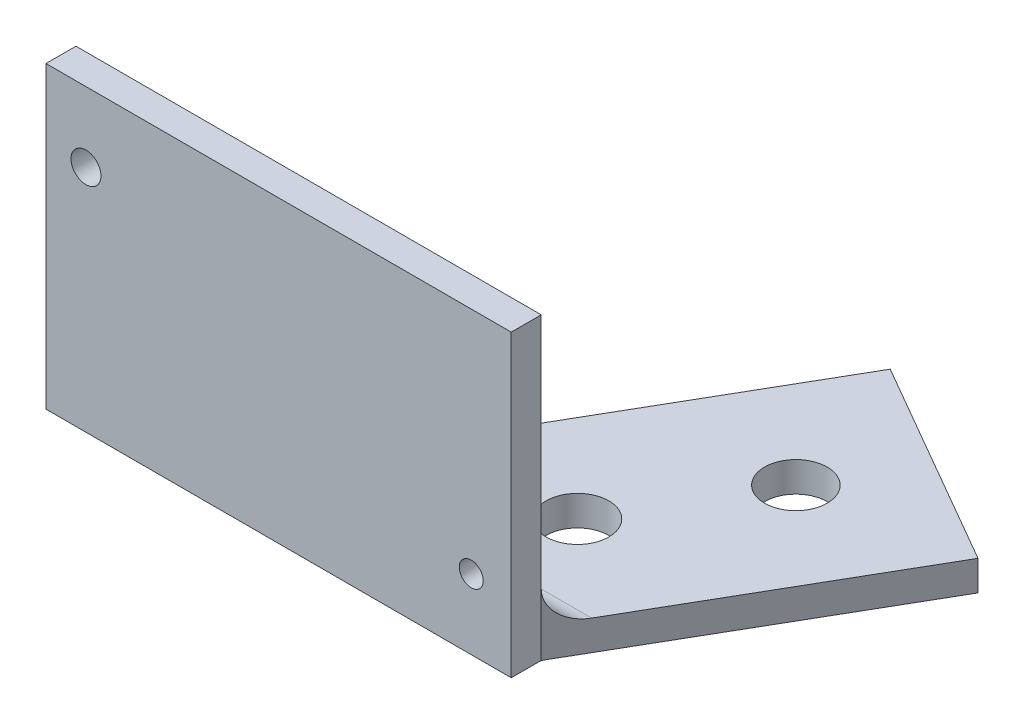
ISO-10303-21;
HEADER;
FILE_DESCRIPTION(('STEP AP214'),'2;1');
FILE_NAME('part.step','',(''),(''),'','','');
FILE_SCHEMA(('AUTOMOTIVE_DESIGN { 1 0 10303 214 1 1 1 1 }'));
ENDSEC;
DATA;
#1=APPLICATION_CONTEXT('core data for automotive mechanical design processes');
#2=APPLICATION_PROTOCOL_DEFINITION('international standard','automotive_design',2000,#1);
#3=PRODUCT_CONTEXT('',#1,'mechanical');
#4=PRODUCT('Part','Part','',(#3));
#5=PRODUCT_RELATED_PRODUCT_CATEGORY('part','',(#4));
#6=PRODUCT_DEFINITION_FORMATION('','',#4);
#7=PRODUCT_DEFINITION_CONTEXT('part definition',#1,'design');
#8=PRODUCT_DEFINITION('design','',#6,#7);
#9=PRODUCT_DEFINITION_SHAPE('','',#8);
#10=(LENGTH_UNIT() NAMED_UNIT(*) SI_UNIT(.MILLI.,.METRE.));
#11=(NAMED_UNIT(*) PLANE_ANGLE_UNIT() SI_UNIT($,.RADIAN.));
#12=(NAMED_UNIT(*) SI_UNIT($,.STERADIAN.) SOLID_ANGLE_UNIT());
#13=UNCERTAINTY_MEASURE_WITH_UNIT(LENGTH_MEASURE(1.E-05),#10,'distance_accuracy_value','');
#14=(GEOMETRIC_REPRESENTATION_CONTEXT(3) GLOBAL_UNCERTAINTY_ASSIGNED_CONTEXT((#13)) GLOBAL_UNIT_ASSIGNED_CONTEXT((#10,
#11,#12)) REPRESENTATION_CONTEXT('',''));
#15=CARTESIAN_POINT('',(0.,0.,0.));
#16=DIRECTION('',(0.,0.,1.));
#17=DIRECTION('',(1.,0.,0.));
#18=AXIS2_PLACEMENT_3D('',#15,#16,#17);
#19=CARTESIAN_POINT('',(0.,0.,2.38125));
#20=DIRECTION('',(0.,0.,-1.));
#21=DIRECTION('',(-1.,0.,0.));
#22=AXIS2_PLACEMENT_3D('',#19,#20,#21);
#23=PLANE('',#22);
#24=DIRECTION('',(0.,-1.,0.));
#25=VECTOR('',#24,1.);
#26=CARTESIAN_POINT('',(-1.5875,-1.5875,2.38125));
#27=LINE('',#26,#25);
#28=CARTESIAN_POINT('',(-1.5875,19.812,2.38125));
#29=VERTEX_POINT('',#28);
#30=CARTESIAN_POINT('',(-1.5875,-3.96875,2.38125));
#31=VERTEX_POINT('',#30);
#32=EDGE_CURVE('E216',#29,#31,#27,.T.);
#33=ORIENTED_EDGE('',*,*,#32,.T.);
#34=DIRECTION('',(-1.,0.,0.));
#35=VECTOR('',#34,1.);
#36=CARTESIAN_POINT('',(-1.5875,-3.96875,2.38125));
#37=LINE('',#36,#35);
#38=CARTESIAN_POINT('',(35.3695,-3.96875,2.38125));
#39=VERTEX_POINT('',#38);
#40=EDGE_CURVE('E156',#39,#31,#37,.T.);
#41=ORIENTED_EDGE('',*,*,#40,.F.);
#42=DIRECTION('',(0.,1.,0.));
#43=VECTOR('',#42,1.);
#44=CARTESIAN_POINT('',(35.3695,-1.5875,2.38125));
#45=LINE('',#44,#43);
#46=CARTESIAN_POINT('',(35.3695,19.812,2.38125));
#47=VERTEX_POINT('',#46);
#48=EDGE_CURVE('E219',#39,#47,#45,.T.);
#49=ORIENTED_EDGE('',*,*,#48,.T.);
#50=DIRECTION('',(-1.,0.,0.));
#51=VECTOR('',#50,1.);
#52=CARTESIAN_POINT('',(-1.5875,19.812,2.38125));
#53=LINE('',#52,#51);
#54=EDGE_CURVE('E223',#47,#29,#53,.T.);
#55=ORIENTED_EDGE('',*,*,#54,.T.);
#56=EDGE_LOOP('',(#33,#41,#49,#55));
#57=FACE_BOUND('',#56,.T.);
#58=CARTESIAN_POINT('',(1.5875,14.25575,2.38125));
#59=DIRECTION('',(0.,0.,1.));
#60=DIRECTION('',(1.,0.,0.));
#61=AXIS2_PLACEMENT_3D('',#58,#59,#60);
#62=CIRCLE('',#61,1.190625);
#63=CARTESIAN_POINT('',(2.778125,14.25575,2.38125));
#64=VERTEX_POINT('',#63);
#65=EDGE_CURVE('E144',#64,#64,#62,.T.);
#66=ORIENTED_EDGE('',*,*,#65,.F.);
#67=EDGE_LOOP('',(#66));
#68=FACE_BOUND('',#67,.T.);
#69=CARTESIAN_POINT('',(32.1945,1.5875,2.38125));
#70=DIRECTION('',(0.,0.,1.));
#71=DIRECTION('',(1.,0.,0.));
#72=AXIS2_PLACEMENT_3D('',#69,#70,#71);
#73=CIRCLE('',#72,0.952500000000004);
#74=CARTESIAN_POINT('',(33.147,1.5875,2.38125));
#75=VERTEX_POINT('',#74);
#76=EDGE_CURVE('E202',#75,#75,#73,.T.);
#77=ORIENTED_EDGE('',*,*,#76,.F.);
#78=EDGE_LOOP('',(#77));
#79=FACE_BOUND('',#78,.T.);
#80=ADVANCED_FACE('F43',(#57,#68,#79),#23,.F.);
#81=CARTESIAN_POINT('',(0.,0.,0.));
#82=DIRECTION('',(0.,0.,-1.));
#83=DIRECTION('',(-1.,0.,0.));
#84=AXIS2_PLACEMENT_3D('',#81,#82,#83);
#85=PLANE('',#84);
#86=CARTESIAN_POINT('',(1.5875,14.25575,0.));
#87=DIRECTION('',(0.,0.,1.));
#88=DIRECTION('',(1.,0.,0.));
#89=AXIS2_PLACEMENT_3D('',#86,#87,#88);
#90=CIRCLE('',#89,1.190625);
#91=CARTESIAN_POINT('',(2.778125,14.25575,0.));
#92=VERTEX_POINT('',#91);
#93=EDGE_CURVE('E206',#92,#92,#90,.T.);
#94=ORIENTED_EDGE('',*,*,#93,.T.);
#95=EDGE_LOOP('',(#94));
#96=FACE_BOUND('',#95,.T.);
#97=DIRECTION('',(0.,1.,0.));
#98=VECTOR('',#97,1.);
#99=CARTESIAN_POINT('',(35.3695,-1.5875,0.));
#100=LINE('',#99,#98);
#101=CARTESIAN_POINT('',(35.3695,0.9525,0.));
#102=VERTEX_POINT('',#101);
#103=CARTESIAN_POINT('',(35.3695,19.812,0.));
#104=VERTEX_POINT('',#103);
#105=EDGE_CURVE('E143',#102,#104,#100,.T.);
#106=ORIENTED_EDGE('',*,*,#105,.F.);
#107=DIRECTION('',(1.,0.,0.));
#108=VECTOR('',#107,1.);
#109=CARTESIAN_POINT('',(13.3724547438752,0.9525,0.));
#110=LINE('',#109,#108);
#111=CARTESIAN_POINT('',(32.9044515828562,0.952499999999999,0.));
#112=VERTEX_POINT('',#111);
#113=EDGE_CURVE('E290',#102,#112,#110,.F.);
#114=ORIENTED_EDGE('',*,*,#113,.T.);
#115=CARTESIAN_POINT('',(32.1945,1.5875,0.));
#116=DIRECTION('',(0.,0.,1.));
#117=DIRECTION('',(1.,0.,0.));
#118=AXIS2_PLACEMENT_3D('',#115,#116,#117);
#119=CIRCLE('',#118,0.952500000000004);
#120=CARTESIAN_POINT('',(31.4845484171438,0.9525,0.));
#121=VERTEX_POINT('',#120);
#122=EDGE_CURVE('E201',#112,#121,#119,.T.);
#123=ORIENTED_EDGE('',*,*,#122,.T.);
#124=DIRECTION('',(1.,0.,0.));
#125=VECTOR('',#124,1.);
#126=CARTESIAN_POINT('',(13.3724547438752,0.9525,0.));
#127=LINE('',#126,#125);
#128=CARTESIAN_POINT('',(13.3724547438752,0.952499999999998,0.));
#129=VERTEX_POINT('',#128);
#130=EDGE_CURVE('E291',#121,#129,#127,.F.);
#131=ORIENTED_EDGE('',*,*,#130,.T.);
#132=DIRECTION('',(0.,1.,0.));
#133=VECTOR('',#132,1.);
#134=CARTESIAN_POINT('',(13.3724547438752,-3.96875,0.));
#135=LINE('',#134,#133);
#136=CARTESIAN_POINT('',(13.3724547438752,-3.96875,0.));
#137=VERTEX_POINT('',#136);
#138=EDGE_CURVE('E72',#137,#129,#135,.T.);
#139=ORIENTED_EDGE('',*,*,#138,.F.);
#140=DIRECTION('',(1.,0.,0.));
#141=VECTOR('',#140,1.);
#142=CARTESIAN_POINT('',(13.3724547438752,-3.96875,0.));
#143=LINE('',#142,#141);
#144=CARTESIAN_POINT('',(-1.5875,-3.96875,0.));
#145=VERTEX_POINT('',#144);
#146=EDGE_CURVE('E146',#145,#137,#143,.T.);
#147=ORIENTED_EDGE('',*,*,#146,.F.);
#148=DIRECTION('',(0.,-1.,0.));
#149=VECTOR('',#148,1.);
#150=CARTESIAN_POINT('',(-1.5875,-1.5875,0.));
#151=LINE('',#150,#149);
#152=CARTESIAN_POINT('',(-1.5875,19.812,0.));
#153=VERTEX_POINT('',#152);
#154=EDGE_CURVE('E132',#153,#145,#151,.T.);
#155=ORIENTED_EDGE('',*,*,#154,.F.);
#156=DIRECTION('',(-1.,0.,0.));
#157=VECTOR('',#156,1.);
#158=CARTESIAN_POINT('',(-1.5875,19.812,0.));
#159=LINE('',#158,#157);
#160=EDGE_CURVE('E220',#104,#153,#159,.T.);
#161=ORIENTED_EDGE('',*,*,#160,.F.);
#162=EDGE_LOOP('',(#106,#114,#123,#131,#139,#147,#155,#161));
#163=FACE_BOUND('',#162,.T.);
#164=ADVANCED_FACE('F147',(#96,#163),#85,.T.);
#165=CARTESIAN_POINT('',(-1.5875,-1.5875,2.38125));
#166=DIRECTION('',(1.,0.,0.));
#167=DIRECTION('',(0.,0.,-1.));
#168=AXIS2_PLACEMENT_3D('',#165,#166,#167);
#169=PLANE('',#168);
#170=ORIENTED_EDGE('',*,*,#154,.T.);
#171=DIRECTION('',(0.,0.,-1.));
#172=VECTOR('',#171,1.);
#173=CARTESIAN_POINT('',(-1.5875,-3.96875,2.38125));
#174=LINE('',#173,#172);
#175=EDGE_CURVE('E137',#31,#145,#174,.T.);
#176=ORIENTED_EDGE('',*,*,#175,.F.);
#177=ORIENTED_EDGE('',*,*,#32,.F.);
#178=DIRECTION('',(0.,0.,-1.));
#179=VECTOR('',#178,1.);
#180=CARTESIAN_POINT('',(-1.5875,19.812,2.38125));
#181=LINE('',#180,#179);
#182=EDGE_CURVE('E139',#29,#153,#181,.T.);
#183=ORIENTED_EDGE('',*,*,#182,.T.);
#184=EDGE_LOOP('',(#170,#176,#177,#183));
#185=FACE_BOUND('',#184,.T.);
#186=ADVANCED_FACE('F134',(#185),#169,.F.);
#187=CARTESIAN_POINT('',(35.3695,-1.5875,2.38125));
#188=DIRECTION('',(-1.,0.,0.));
#189=DIRECTION('',(0.,0.,1.));
#190=AXIS2_PLACEMENT_3D('',#187,#188,#189);
#191=PLANE('',#190);
#192=DIRECTION('',(0.,1.,0.));
#193=VECTOR('',#192,1.);
#194=CARTESIAN_POINT('',(35.3695,-3.96875,0.));
#195=LINE('',#194,#193);
#196=CARTESIAN_POINT('',(35.3695,-3.96875,0.));
#197=VERTEX_POINT('',#196);
#198=EDGE_CURVE('E65',#197,#102,#195,.T.);
#199=ORIENTED_EDGE('',*,*,#198,.T.);
#200=ORIENTED_EDGE('',*,*,#105,.T.);
#201=DIRECTION('',(0.,0.,-1.));
#202=VECTOR('',#201,1.);
#203=CARTESIAN_POINT('',(35.3695,19.812,2.38125));
#204=LINE('',#203,#202);
#205=EDGE_CURVE('E232',#47,#104,#204,.T.);
#206=ORIENTED_EDGE('',*,*,#205,.F.);
#207=ORIENTED_EDGE('',*,*,#48,.F.);
#208=DIRECTION('',(0.,0.,1.));
#209=VECTOR('',#208,1.);
#210=CARTESIAN_POINT('',(35.3695,-3.96875,2.38125));
#211=LINE('',#210,#209);
#212=EDGE_CURVE('E178',#197,#39,#211,.T.);
#213=ORIENTED_EDGE('',*,*,#212,.F.);
#214=EDGE_LOOP('',(#199,#200,#206,#207,#213));
#215=FACE_BOUND('',#214,.T.);
#216=ADVANCED_FACE('F317',(#215),#191,.F.);
#217=CARTESIAN_POINT('',(-1.5875,19.812,2.38125));
#218=DIRECTION('',(0.,-1.,0.));
#219=DIRECTION('',(1.,0.,0.));
#220=AXIS2_PLACEMENT_3D('',#217,#218,#219);
#221=PLANE('',#220);
#222=ORIENTED_EDGE('',*,*,#160,.T.);
#223=ORIENTED_EDGE('',*,*,#182,.F.);
#224=ORIENTED_EDGE('',*,*,#54,.F.);
#225=ORIENTED_EDGE('',*,*,#205,.T.);
#226=EDGE_LOOP('',(#222,#223,#224,#225));
#227=FACE_BOUND('',#226,.T.);
#228=ADVANCED_FACE('F323',(#227),#221,.F.);
#229=CARTESIAN_POINT('',(1.5875,14.25575,2.38125));
#230=DIRECTION('',(0.,0.,-1.));
#231=DIRECTION('',(-1.,0.,0.));
#232=AXIS2_PLACEMENT_3D('',#229,#230,#231);
#233=CYLINDRICAL_SURFACE('',#232,1.190625);
#234=ORIENTED_EDGE('',*,*,#65,.T.);
#235=EDGE_LOOP('',(#234));
#236=FACE_BOUND('',#235,.T.);
#237=ORIENTED_EDGE('',*,*,#93,.F.);
#238=EDGE_LOOP('',(#237));
#239=FACE_BOUND('',#238,.T.);
#240=ADVANCED_FACE('F328',(#236,#239),#233,.F.);
#241=CARTESIAN_POINT('',(32.1945,1.5875,2.38125));
#242=DIRECTION('',(0.,0.,-1.));
#243=DIRECTION('',(-1.,0.,0.));
#244=AXIS2_PLACEMENT_3D('',#241,#242,#243);
#245=CYLINDRICAL_SURFACE('',#244,0.952500000000004);
#246=ORIENTED_EDGE('',*,*,#76,.T.);
#247=EDGE_LOOP('',(#246));
#248=FACE_BOUND('',#247,.T.);
#249=EDGE_CURVE('E207',#121,#112,#119,.T.);
#250=ORIENTED_EDGE('',*,*,#249,.F.);
#251=ORIENTED_EDGE('',*,*,#122,.F.);
#252=EDGE_LOOP('',(#250,#251));
#253=FACE_BOUND('',#252,.T.);
#254=ADVANCED_FACE('F276',(#248,#253),#245,.F.);
#255=CARTESIAN_POINT('',(31.5717160579066,-3.96875,-31.5220452561248));
#256=DIRECTION('',(0.866025403784436,0.,0.500000000000004));
#257=DIRECTION('',(0.500000000000004,0.,-0.866025403784436));
#258=AXIS2_PLACEMENT_3D('',#255,#256,#257);
#259=PLANE('',#258);
#260=ORIENTED_EDGE('',*,*,#138,.T.);
#261=CARTESIAN_POINT('',(14.8389244276169,0.9525,-2.54));
#262=DIRECTION('',(0.866025403784436,0.,0.500000000000004));
#263=DIRECTION('',(-0.500000000000004,0.,0.866025403784436));
#264=AXIS2_PLACEMENT_3D('',#261,#262,#263);
#265=ELLIPSE('',#264,2.93293936748331,2.54);
#266=CARTESIAN_POINT('',(14.8389244276169,-1.5875,-2.54));
#267=VERTEX_POINT('',#266);
#268=EDGE_CURVE('E11',#129,#267,#265,.T.);
#269=ORIENTED_EDGE('',*,*,#268,.T.);
#270=DIRECTION('',(0.500000000000004,0.,-0.866025403784436));
#271=VECTOR('',#270,1.);
#272=CARTESIAN_POINT('',(31.5717160579066,-1.5875,-31.5220452561248));
#273=LINE('',#272,#271);
#274=CARTESIAN_POINT('',(31.5717160579066,-1.5875,-31.5220452561248));
#275=VERTEX_POINT('',#274);
#276=EDGE_CURVE('E183',#267,#275,#273,.T.);
#277=ORIENTED_EDGE('',*,*,#276,.T.);
#278=DIRECTION('',(0.,1.,0.));
#279=VECTOR('',#278,1.);
#280=CARTESIAN_POINT('',(31.5717160579066,-3.96875,-31.5220452561248));
#281=LINE('',#280,#279);
#282=CARTESIAN_POINT('',(31.5717160579066,-3.96875,-31.5220452561248));
#283=VERTEX_POINT('',#282);
#284=EDGE_CURVE('E195',#283,#275,#281,.T.);
#285=ORIENTED_EDGE('',*,*,#284,.F.);
#286=DIRECTION('',(0.500000000000004,0.,-0.866025403784436));
#287=VECTOR('',#286,1.);
#288=CARTESIAN_POINT('',(31.5717160579066,-3.96875,-31.5220452561248));
#289=LINE('',#288,#287);
#290=EDGE_CURVE('E150',#137,#283,#289,.T.);
#291=ORIENTED_EDGE('',*,*,#290,.F.);
#292=EDGE_LOOP('',(#260,#269,#277,#285,#291));
#293=FACE_BOUND('',#292,.T.);
#294=ADVANCED_FACE('F316',(#293),#259,.F.);
#295=CARTESIAN_POINT('',(48.0695000000001,-3.96875,-21.9970452561247));
#296=DIRECTION('',(-0.500000000000005,0.,0.866025403784436));
#297=DIRECTION('',(0.866025403784436,0.,0.500000000000005));
#298=AXIS2_PLACEMENT_3D('',#295,#296,#297);
#299=PLANE('',#298);
#300=DIRECTION('',(0.866025403784436,0.,0.500000000000005));
#301=VECTOR('',#300,1.);
#302=CARTESIAN_POINT('',(48.0695000000001,-1.5875,-21.9970452561247));
#303=LINE('',#302,#301);
#304=CARTESIAN_POINT('',(48.0695000000001,-1.5875,-21.9970452561247));
#305=VERTEX_POINT('',#304);
#306=EDGE_CURVE('E164',#275,#305,#303,.T.);
#307=ORIENTED_EDGE('',*,*,#306,.T.);
#308=DIRECTION('',(0.,1.,0.));
#309=VECTOR('',#308,1.);
#310=CARTESIAN_POINT('',(48.0695000000001,-3.96875,-21.9970452561247));
#311=LINE('',#310,#309);
#312=CARTESIAN_POINT('',(48.0695000000001,-3.96875,-21.9970452561247));
#313=VERTEX_POINT('',#312);
#314=EDGE_CURVE('E191',#313,#305,#311,.T.);
#315=ORIENTED_EDGE('',*,*,#314,.F.);
#316=DIRECTION('',(0.866025403784436,0.,0.500000000000005));
#317=VECTOR('',#316,1.);
#318=CARTESIAN_POINT('',(48.0695000000001,-3.96875,-21.9970452561247));
#319=LINE('',#318,#317);
#320=EDGE_CURVE('E172',#283,#313,#319,.T.);
#321=ORIENTED_EDGE('',*,*,#320,.F.);
#322=ORIENTED_EDGE('',*,*,#284,.T.);
#323=EDGE_LOOP('',(#307,#315,#321,#322));
#324=FACE_BOUND('',#323,.T.);
#325=ADVANCED_FACE('F314',(#324),#299,.F.);
#326=CARTESIAN_POINT('',(48.0695000000001,-3.96875,-21.9970452561247));
#327=DIRECTION('',(-0.866025403784436,0.,-0.500000000000004));
#328=DIRECTION('',(-0.500000000000004,0.,0.866025403784436));
#329=AXIS2_PLACEMENT_3D('',#326,#327,#328);
#330=PLANE('',#329);
#331=DIRECTION('',(-0.500000000000004,0.,0.866025403784436));
#332=VECTOR('',#331,1.);
#333=CARTESIAN_POINT('',(48.0695000000001,-1.5875,-21.9970452561247));
#334=LINE('',#333,#332);
#335=CARTESIAN_POINT('',(36.8359696837417,-1.5875,-2.54));
#336=VERTEX_POINT('',#335);
#337=EDGE_CURVE('E158',#305,#336,#334,.T.);
#338=ORIENTED_EDGE('',*,*,#337,.T.);
#339=CARTESIAN_POINT('',(36.8359696837417,0.9525,-2.54));
#340=DIRECTION('',(-0.866025403784436,0.,-0.500000000000004));
#341=DIRECTION('',(-0.500000000000004,0.,0.866025403784436));
#342=AXIS2_PLACEMENT_3D('',#339,#340,#341);
#343=ELLIPSE('',#342,2.93293936748331,2.54);
#344=EDGE_CURVE('E57',#336,#102,#343,.T.);
#345=ORIENTED_EDGE('',*,*,#344,.T.);
#346=ORIENTED_EDGE('',*,*,#198,.F.);
#347=DIRECTION('',(-0.500000000000004,0.,0.866025403784436));
#348=VECTOR('',#347,1.);
#349=CARTESIAN_POINT('',(48.0695000000001,-3.96875,-21.9970452561247));
#350=LINE('',#349,#348);
#351=EDGE_CURVE('E175',#313,#197,#350,.T.);
#352=ORIENTED_EDGE('',*,*,#351,.F.);
#353=ORIENTED_EDGE('',*,*,#314,.T.);
#354=EDGE_LOOP('',(#338,#345,#346,#352,#353));
#355=FACE_BOUND('',#354,.T.);
#356=ADVANCED_FACE('F260',(#355),#330,.F.);
#357=CARTESIAN_POINT('',(0.,-3.96875,0.));
#358=DIRECTION('',(0.,1.,0.));
#359=DIRECTION('',(0.,0.,1.));
#360=AXIS2_PLACEMENT_3D('',#357,#358,#359);
#361=PLANE('',#360);
#362=CARTESIAN_POINT('',(35.8009773719377,-3.96875,-19.7973407305122));
#363=DIRECTION('',(0.,1.,0.));
#364=DIRECTION('',(0.,0.,1.));
#365=AXIS2_PLACEMENT_3D('',#362,#363,#364);
#366=CIRCLE('',#365,2.48919999999999);
#367=CARTESIAN_POINT('',(35.8009773719377,-3.96875,-17.3081407305122));
#368=VERTEX_POINT('',#367);
#369=EDGE_CURVE('E186',#368,#368,#366,.F.);
#370=ORIENTED_EDGE('',*,*,#369,.F.);
#371=EDGE_LOOP('',(#370));
#372=FACE_BOUND('',#371,.T.);
#373=CARTESIAN_POINT('',(29.4509773719376,-3.96875,-8.79881810244987));
#374=DIRECTION('',(0.,1.,0.));
#375=DIRECTION('',(0.,0.,1.));
#376=AXIS2_PLACEMENT_3D('',#373,#374,#375);
#377=CIRCLE('',#376,2.48919999999999);
#378=CARTESIAN_POINT('',(29.4509773719376,-3.96875,-6.30961810244988));
#379=VERTEX_POINT('',#378);
#380=EDGE_CURVE('E167',#379,#379,#377,.F.);
#381=ORIENTED_EDGE('',*,*,#380,.F.);
#382=EDGE_LOOP('',(#381));
#383=FACE_BOUND('',#382,.T.);
#384=ORIENTED_EDGE('',*,*,#175,.T.);
#385=ORIENTED_EDGE('',*,*,#146,.T.);
#386=ORIENTED_EDGE('',*,*,#290,.T.);
#387=ORIENTED_EDGE('',*,*,#320,.T.);
#388=ORIENTED_EDGE('',*,*,#351,.T.);
#389=ORIENTED_EDGE('',*,*,#212,.T.);
#390=ORIENTED_EDGE('',*,*,#40,.T.);
#391=EDGE_LOOP('',(#384,#385,#386,#387,#388,#389,#390));
#392=FACE_BOUND('',#391,.T.);
#393=ADVANCED_FACE('F153',(#372,#383,#392),#361,.F.);
#394=CARTESIAN_POINT('',(0.,-1.5875,0.));
#395=DIRECTION('',(0.,1.,0.));
#396=DIRECTION('',(0.,0.,1.));
#397=AXIS2_PLACEMENT_3D('',#394,#395,#396);
#398=PLANE('',#397);
#399=CARTESIAN_POINT('',(35.8009773719377,-1.5875,-19.7973407305122));
#400=DIRECTION('',(0.,1.,0.));
#401=DIRECTION('',(0.,0.,1.));
#402=AXIS2_PLACEMENT_3D('',#399,#400,#401);
#403=CIRCLE('',#402,2.48919999999999);
#404=CARTESIAN_POINT('',(35.8009773719377,-1.5875,-17.3081407305122));
#405=VERTEX_POINT('',#404);
#406=EDGE_CURVE('E490',#405,#405,#403,.T.);
#407=ORIENTED_EDGE('',*,*,#406,.F.);
#408=EDGE_LOOP('',(#407));
#409=FACE_BOUND('',#408,.T.);
#410=CARTESIAN_POINT('',(29.4509773719376,-1.5875,-8.79881810244987));
#411=DIRECTION('',(0.,1.,0.));
#412=DIRECTION('',(0.,0.,1.));
#413=AXIS2_PLACEMENT_3D('',#410,#411,#412);
#414=CIRCLE('',#413,2.48919999999999);
#415=CARTESIAN_POINT('',(29.4509773719376,-1.5875,-6.30961810244988));
#416=VERTEX_POINT('',#415);
#417=EDGE_CURVE('E285',#416,#416,#414,.T.);
#418=ORIENTED_EDGE('',*,*,#417,.F.);
#419=EDGE_LOOP('',(#418));
#420=FACE_BOUND('',#419,.T.);
#421=ORIENTED_EDGE('',*,*,#276,.F.);
#422=DIRECTION('',(1.,0.,0.));
#423=VECTOR('',#422,1.);
#424=CARTESIAN_POINT('',(35.3695,-1.5875,-2.54));
#425=LINE('',#424,#423);
#426=CARTESIAN_POINT('',(31.4845484171438,-1.5875,-2.54));
#427=VERTEX_POINT('',#426);
#428=EDGE_CURVE('E246',#267,#427,#425,.T.);
#429=ORIENTED_EDGE('',*,*,#428,.T.);
#430=CARTESIAN_POINT('',(33.0692999017509,1.2106958308397,0.));
#431=CARTESIAN_POINT('',(33.0014712577612,-1.5875,0.277761115839572));
#432=CARTESIAN_POINT('',(33.6687351526644,-1.5875,-2.45471226275083));
#433=CARTESIAN_POINT('',(33.0649493760835,1.20066299174167,0.));
#434=CARTESIAN_POINT('',(33.0048063145353,-1.5875,0.267064646921252));
#435=CARTESIAN_POINT('',(33.6222502111467,-1.5875,-2.4660699515731));
#436=CARTESIAN_POINT('',(33.0601192943247,1.18986337126937,0.));
#437=CARTESIAN_POINT('',(33.0072355004681,-1.5875,0.255271056876502));
#438=CARTESIAN_POINT('',(33.5754734478419,-1.5875,-2.47621055300328));
#439=CARTESIAN_POINT('',(33.0489447606538,1.16635421885707,0.));
#440=CARTESIAN_POINT('',(33.0094209974983,-1.5875,0.229307890928058));
#441=CARTESIAN_POINT('',(33.4814897764869,-1.5875,-2.49413046805221));
#442=CARTESIAN_POINT('',(33.0426009604331,1.15364550969433,0.));
#443=CARTESIAN_POINT('',(33.0091910892721,-1.5875,0.215161557368592));
#444=CARTESIAN_POINT('',(33.4342830619299,-1.5875,-2.50191079455947));
#445=CARTESIAN_POINT('',(33.0279174612061,1.12607751024489,0.));
#446=CARTESIAN_POINT('',(33.0052882623959,-1.5875,0.184479367763835));
#447=CARTESIAN_POINT('',(33.340043851604,-1.5875,-2.5151238278455));
#448=CARTESIAN_POINT('',(33.0195991360774,1.11124188157453,0.));
#449=CARTESIAN_POINT('',(33.001672680499,-1.5875,0.167999062552473));
#450=CARTESIAN_POINT('',(33.2930146234616,-1.5875,-2.52058003682317));
#451=CARTESIAN_POINT('',(33.0000656961369,1.07889406406731,0.));
#452=CARTESIAN_POINT('',(32.9899569107736,-1.5875,0.132427337531588));
#453=CARTESIAN_POINT('',(33.198757152589,-1.5875,-2.52939150029441));
#454=CARTESIAN_POINT('',(32.9888502815108,1.06138159828625,0.));
#455=CARTESIAN_POINT('',(32.9818924006681,-1.5875,0.113371638870963));
#456=CARTESIAN_POINT('',(33.1515288897591,-1.5875,-2.53274653721851));
#457=CARTESIAN_POINT('',(32.9622627883849,1.02328462008303,0.));
#458=CARTESIAN_POINT('',(32.9598687090111,-1.5875,0.0726841033378057));
#459=CARTESIAN_POINT('',(33.0569906293649,-1.5875,-2.5375455619213));
#460=CARTESIAN_POINT('',(32.9468917663299,1.00270088903774,0.));
#461=CARTESIAN_POINT('',(32.9459692352721,-1.5875,0.0510963770627656));
#462=CARTESIAN_POINT('',(33.0096806556065,-1.5875,-2.5389900348573));
#463=CARTESIAN_POINT('',(32.9101539263323,0.958269933551349,0.));
#464=CARTESIAN_POINT('',(32.9104793698422,-1.5875,0.00569031483444232));
#465=CARTESIAN_POINT('',(32.9150468740514,-1.5875,-2.5402506993597));
#466=CARTESIAN_POINT('',(32.888787614152,0.934422984482088,0.));
#467=CARTESIAN_POINT('',(32.8889778413449,-1.5875,-0.0180816429906292));
#468=CARTESIAN_POINT('',(32.8677230677579,-1.5875,-2.54006702823631));
#469=CARTESIAN_POINT('',(32.8374573807926,0.883815850601244,0.));
#470=CARTESIAN_POINT('',(32.8360901972884,-1.5875,-0.0669587187338391));
#471=CARTESIAN_POINT('',(32.7730087935178,-1.5875,-2.53847213285447));
#472=CARTESIAN_POINT('',(32.8074769162276,0.857050122269502,0.));
#473=CARTESIAN_POINT('',(32.804805586983,-1.5875,-0.0920308803853365));
#474=CARTESIAN_POINT('',(32.7256183735943,-1.5875,-2.53705853583964));
#475=CARTESIAN_POINT('',(32.7538150813141,0.816190385787285,0.));
#476=CARTESIAN_POINT('',(32.7488340315505,-1.5875,-0.129120475739469));
#477=CARTESIAN_POINT('',(32.6545482029237,-1.5875,-2.53444014075199));
#478=CARTESIAN_POINT('',(32.7344766692034,0.802450395918323,0.));
#479=CARTESIAN_POINT('',(32.7287622014793,-1.5875,-0.141351801945108));
#480=CARTESIAN_POINT('',(32.6308581121642,-1.5875,-2.5334842096354));
#481=CARTESIAN_POINT('',(32.6925837721007,0.775221985755937,0.));
#482=CARTESIAN_POINT('',(32.6855301882946,-1.5875,-0.165191997363054));
#483=CARTESIAN_POINT('',(32.5834808761158,-1.5875,-2.53149419246097));
#484=CARTESIAN_POINT('',(32.6700292469045,0.761733568609772,0.));
#485=CARTESIAN_POINT('',(32.6623826121017,-1.5875,-0.176805537520036));
#486=CARTESIAN_POINT('',(32.5597937308673,-1.5875,-2.53046010542621));
#487=CARTESIAN_POINT('',(32.6091240212498,0.728972305394364,0.));
#488=CARTESIAN_POINT('',(32.6004487152796,-1.5875,-0.204536963453388));
#489=CARTESIAN_POINT('',(32.5003593262729,-1.5875,-2.52788385953011));
#490=CARTESIAN_POINT('',(32.5685772768692,0.71025062086094,0.));
#491=CARTESIAN_POINT('',(32.5596043958583,-1.5875,-0.220014251293308));
#492=CARTESIAN_POINT('',(32.4646116371859,-1.5875,-2.52635106220542));
#493=CARTESIAN_POINT('',(32.4800063264668,0.677579977266468,0.));
#494=CARTESIAN_POINT('',(32.4716000061884,-1.5875,-0.246520264247603));
#495=CARTESIAN_POINT('',(32.3931022829211,-1.5875,-2.52364939065413));
#496=CARTESIAN_POINT('',(32.4319823030397,0.66363090168523,0.));
#497=CARTESIAN_POINT('',(32.4243998142152,-1.5875,-0.257598098705576));
#498=CARTESIAN_POINT('',(32.3573406181059,-1.5875,-2.52248050754285));
#499=CARTESIAN_POINT('',(32.3308445290396,0.643408039989066,0.));
#500=CARTESIAN_POINT('',(32.325999783557,-1.5875,-0.273493140157611));
#501=CARTESIAN_POINT('',(32.2858188990347,-1.5875,-2.52078453844386));
#502=CARTESIAN_POINT('',(32.2777333727165,0.637130363980252,0.));
#503=CARTESIAN_POINT('',(32.2746830785738,-1.5875,-0.278357235783302));
#504=CARTESIAN_POINT('',(32.2500588531641,-1.5875,-2.52025712718921));
#505=CARTESIAN_POINT('',(32.1706300371423,0.633794798816263,0.));
#506=CARTESIAN_POINT('',(32.1715167833265,-1.5875,-0.280942616267311));
#507=CARTESIAN_POINT('',(32.1785359827611,-1.5875,-2.51997682615275));
#508=CARTESIAN_POINT('',(32.1166378710342,0.636736772245921,0.));
#509=CARTESIAN_POINT('',(32.1195011897372,-1.5875,-0.278672346667566));
#510=CARTESIAN_POINT('',(32.142773158278,-1.5875,-2.52022392482718));
#511=CARTESIAN_POINT('',(32.0124606122548,0.651075858697316,0.));
#512=CARTESIAN_POINT('',(32.0186784462365,-1.5875,-0.267485527491931));
#513=CARTESIAN_POINT('',(32.0713237504813,-1.5875,-2.52142808746478));
#514=CARTESIAN_POINT('',(31.9622689603857,0.66245802071419,0.));
#515=CARTESIAN_POINT('',(31.9697232432501,-1.5875,-0.258547302455054));
#516=CARTESIAN_POINT('',(32.0356371441208,-1.5875,-2.52238389601449));
#517=CARTESIAN_POINT('',(31.8687066383386,0.691104698155763,0.));
#518=CARTESIAN_POINT('',(31.8775608459835,-1.5875,-0.235618037056843));
#519=CARTESIAN_POINT('',(31.9642794671431,-1.5875,-2.52477132841269));
#520=CARTESIAN_POINT('',(31.8253362918862,0.708369492635513,0.));
#521=CARTESIAN_POINT('',(31.834284705037,-1.5875,-0.221576366735798));
#522=CARTESIAN_POINT('',(31.9286083973434,-1.5875,-2.52620297483349));
#523=CARTESIAN_POINT('',(31.7464296277357,0.745830265533091,0.));
#524=CARTESIAN_POINT('',(31.7546616019289,-1.5875,-0.190371853168021));
#525=CARTESIAN_POINT('',(31.8572493822973,-1.5875,-2.52922418998172));
#526=CARTESIAN_POINT('',(31.71089860366,0.76602820943601,0.));
#527=CARTESIAN_POINT('',(31.7183217748563,-1.5875,-0.173168006821405));
#528=CARTESIAN_POINT('',(31.8215614418569,-1.5875,-2.53081386437559));
#529=CARTESIAN_POINT('',(31.6472162882517,0.80700397135539,0.));
#530=CARTESIAN_POINT('',(31.652648180975,-1.5875,-0.137359211320185));
#531=CARTESIAN_POINT('',(31.7501786408679,-1.5875,-2.53382448844483));
#532=CARTESIAN_POINT('',(31.6190648540496,0.827781778137039,0.));
#533=CARTESIAN_POINT('',(31.6233576934857,-1.5875,-0.118738127600857));
#534=CARTESIAN_POINT('',(31.7144837804667,-1.5875,-2.53524544138637));
#535=CARTESIAN_POINT('',(31.5688560726798,0.868558666194741,0.));
#536=CARTESIAN_POINT('',(31.5710486241808,-1.5875,-0.0812636567569016));
#537=CARTESIAN_POINT('',(31.6429262325258,-1.5875,-2.53763684077322));
#538=CARTESIAN_POINT('',(31.5468250869161,0.888554069669537,0.));
#539=CARTESIAN_POINT('',(31.5481143474946,-1.5875,-0.0624135488163075));
#540=CARTESIAN_POINT('',(31.607063475456,-1.5875,-2.53860535032925));
#541=CARTESIAN_POINT('',(31.5077128818534,0.926947461329643,0.));
#542=CARTESIAN_POINT('',(31.5077948316232,-1.5875,-0.0253710929673624));
#543=CARTESIAN_POINT('',(31.5353247641815,-1.5875,-2.53984641708503));
#544=CARTESIAN_POINT('',(31.4906316342794,0.94534545863955,0.));
#545=CARTESIAN_POINT('',(31.490461930211,-1.5875,-0.00719363524927888));
#546=CARTESIAN_POINT('',(31.4994488100533,-1.5875,-2.54011897826038));
#547=CARTESIAN_POINT('',(31.460284106069,0.980279231780599,0.));
#548=CARTESIAN_POINT('',(31.4604469639577,-1.5875,0.0280235890178959));
#549=CARTESIAN_POINT('',(31.4277270315108,-1.5875,-2.53978368216029));
#550=CARTESIAN_POINT('',(31.4470149281718,0.996816416026066,0.));
#551=CARTESIAN_POINT('',(31.4478034342722,-1.5875,0.0450448315626955));
#552=CARTESIAN_POINT('',(31.39188120497,-1.5875,-2.53917649564587));
#553=CARTESIAN_POINT('',(31.4233603737994,1.0280514060845,0.));
#554=CARTESIAN_POINT('',(31.4263291060848,-1.5875,0.0777288605502624));
#555=CARTESIAN_POINT('',(31.3202216491129,-1.5875,-2.53694225172737));
#556=CARTESIAN_POINT('',(31.41297487996,1.04274928674268,0.));
#557=CARTESIAN_POINT('',(31.4175296713024,-1.5875,0.093371888762447));
#558=CARTESIAN_POINT('',(31.2844079185495,-1.5875,-2.53531523583854));
#559=CARTESIAN_POINT('',(31.3943477494454,1.07049664780323,0.));
#560=CARTESIAN_POINT('',(31.4030121671875,-1.5875,0.123272647446753));
#561=CARTESIAN_POINT('',(31.2126942162413,-1.5875,-2.53092566783829));
#562=CARTESIAN_POINT('',(31.3861155413635,1.08353875403107,0.));
#563=CARTESIAN_POINT('',(31.3973305013809,-1.5875,0.137505474721342));
#564=CARTESIAN_POINT('',(31.1767945376431,-1.5875,-2.52815825397535));
#565=CARTESIAN_POINT('',(31.3713255177162,1.10807911151427,0.));
#566=CARTESIAN_POINT('',(31.3885224661517,-1.5875,0.164499868322635));
#567=CARTESIAN_POINT('',(31.1051101813737,-1.5875,-2.52140760740193));
#568=CARTESIAN_POINT('',(31.3647676431062,1.11957741720435,0.));
#569=CARTESIAN_POINT('',(31.3854118288912,-1.5875,0.177245716877537));
#570=CARTESIAN_POINT('',(31.0693254996913,-1.5875,-2.51742441757617));
#571=CARTESIAN_POINT('',(31.3529123275428,1.14124843836235,0.));
#572=CARTESIAN_POINT('',(31.3812567719717,-1.5875,0.201338422809998));
#573=CARTESIAN_POINT('',(30.9978231958356,-1.5875,-2.50816977864448));
#574=CARTESIAN_POINT('',(31.347618364839,1.15141746170743,0.));
#575=CARTESIAN_POINT('',(31.3802287599436,-1.5875,0.212667994570833));
#576=CARTESIAN_POINT('',(30.9621060210867,-1.5875,-2.50289485362101));
#577=CARTESIAN_POINT('',(31.3380344904532,1.17056817574479,0.));
#578=CARTESIAN_POINT('',(31.379883254263,-1.5875,0.233951938683113));
#579=CARTESIAN_POINT('',(30.8908864156477,-1.5875,-2.49102140594675));
#580=CARTESIAN_POINT('',(31.333744749716,1.17954966417442,0.));
#581=CARTESIAN_POINT('',(31.3805731915914,-1.5875,0.243895211570434));
#582=CARTESIAN_POINT('',(30.8553840225197,-1.5875,-2.48442265830113));
#583=CARTESIAN_POINT('',(31.3298182260634,1.18802324245099,0.));
#584=CARTESIAN_POINT('',(31.3819208767503,-1.5875,0.253170100152787));
#585=CARTESIAN_POINT('',(30.8200199307226,-1.5875,-2.47714240614731));
#586=(BOUNDED_SURFACE() B_SPLINE_SURFACE(3,2,((#430,#431,#432),(#433,#434,#435),(#436,#437,
#438),(#439,#440,#441),(#442,#443,#444),(#445,#446,#447),(#448,#449,#450),(#451,#452,#453),
(#454,#455,#456),(#457,#458,#459),(#460,#461,#462),(#463,#464,#465),(#466,#467,#468),(#469,#470,
#471),(#472,#473,#474),(#475,#476,#477),(#478,#479,#480),(#481,#482,#483),(#484,#485,#486),
(#487,#488,#489),(#490,#491,#492),(#493,#494,#495),(#496,#497,#498),(#499,#500,#501),(#502,#503,
#504),(#505,#506,#507),(#508,#509,#510),(#511,#512,#513),(#514,#515,#516),(#517,#518,#519),
(#520,#521,#522),(#523,#524,#525),(#526,#527,#528),(#529,#530,#531),(#532,#533,#534),(#535,#536,
#537),(#538,#539,#540),(#541,#542,#543),(#544,#545,#546),(#547,#548,#549),(#550,#551,#552),
(#553,#554,#555),(#556,#557,#558),(#559,#560,#561),(#562,#563,#564),(#565,#566,#567),(#568,#569,
#570),(#571,#572,#573),(#574,#575,#576),(#577,#578,#579),(#580,#581,#582),(#583,#584,#585)),
.UNSPECIFIED.,.F.,.F.,.F.) B_SPLINE_SURFACE_WITH_KNOTS((4,2,2,2,2,2,2,2,2,2,2,2,2,2,2,2,2,2,2,2,
2,2,2,2,2,4),(3,3),(0.,0.143532960948694,0.287004238735484,0.428988109534989,0.570986679868543,
0.712949184998812,0.854899717776485,0.997124708327334,1.06825288564164,1.13938195219705,
1.24672325997439,1.35406194689543,1.46134618357133,1.56862882122641,1.67572187034243,
1.78282000035006,1.88999023016078,1.99715838499377,2.10478120999037,2.21240342019053,
2.31994361732329,2.42747943699059,2.5354785264365,2.64347380681166,2.75176294703027,
2.86007050751785),(0.,1.),
.UNSPECIFIED.) GEOMETRIC_REPRESENTATION_ITEM() RATIONAL_B_SPLINE_SURFACE(((1.,0.670204483010449,
1.),(1.,0.671677455132728,1.),(1.,0.673259018190831,1.),(1.,0.67668738050067,1.),(1.,
0.678534065475301,1.),(1.,0.68252113294668,1.),(1.,0.684658272116186,1.),(1.,0.689292874645622,
1.),(1.,0.691790375286865,1.),(1.,0.69718956278595,1.),(1.,0.700091146826313,1.),(1.,
0.706310020364893,1.),(1.,0.709627274784115,1.),(1.,0.716611813902377,1.),(1.,0.720279762975156,
1.),(1.,0.725834755123291,1.),(1.,0.727695471954071,1.),(1.,0.731369002657336,1.),(1.,
0.73318181593065,1.),(1.,0.737569231777846,1.),(1.,0.740061804640732,1.),(1.,0.744394324967744,
1.),(1.,0.746234288364953,1.),(1.,0.748897056792008,1.),(1.,0.749720377327511,1.),(1.,
0.750158205317387,1.),(1.,0.749772730788365,1.),(1.,0.747887829444777,1.),(1.,0.746390372396614,
1.),(1.,0.742603009647671,1.),(1.,0.740313066353556,1.),(1.,0.735315752204184,1.),(1.,
0.732608101369298,1.),(1.,0.727082273954357,1.),(1.,0.724264099515262,1.),(1.,0.718701399696325,
1.),(1.,0.715957237504828,1.),(1.,0.710659605840467,1.),(1.,0.708106135278359,1.),(1.,
0.703233668993427,1.),(1.,0.700914496072841,1.),(1.,0.69651455187576,1.),(1.,0.694433770898876,
1.),(1.,0.69048984132186,1.),(1.,0.688627668910914,1.),(1.,0.685111142017789,1.),(1.,
0.683456780208296,1.),(1.,0.68032878966206,1.),(1.,0.678855664956872,1.),(1.,0.676073272729448,
1.),(1.,0.674764033122377,1.),(1.,0.673525914124942,1.))) REPRESENTATION_ITEM('') SURFACE());
#587=CARTESIAN_POINT('',(30.8200199307226,-1.5875,-2.47714240614731));
#588=CARTESIAN_POINT('',(30.8553840225197,-1.5875,-2.48442265830113));
#589=CARTESIAN_POINT('',(30.8908864156477,-1.5875,-2.49102140594675));
#590=CARTESIAN_POINT('',(30.9621060210867,-1.5875,-2.50289485362101));
#591=CARTESIAN_POINT('',(30.9978231958356,-1.5875,-2.50816977864448));
#592=CARTESIAN_POINT('',(31.0693254996913,-1.5875,-2.51742441757617));
#593=CARTESIAN_POINT('',(31.1051101813737,-1.5875,-2.52140760740193));
#594=CARTESIAN_POINT('',(31.1767945376431,-1.5875,-2.52815825397535));
#595=CARTESIAN_POINT('',(31.2126942162413,-1.5875,-2.53092566783829));
#596=CARTESIAN_POINT('',(31.2844079185495,-1.5875,-2.53531523583854));
#597=CARTESIAN_POINT('',(31.3202216491129,-1.5875,-2.53694225172737));
#598=CARTESIAN_POINT('',(31.39188120497,-1.5875,-2.53917649564587));
#599=CARTESIAN_POINT('',(31.4277270315108,-1.5875,-2.53978368216029));
#600=CARTESIAN_POINT('',(31.4994488100533,-1.5875,-2.54011897826038));
#601=CARTESIAN_POINT('',(31.5353247641815,-1.5875,-2.53984641708503));
#602=CARTESIAN_POINT('',(31.607063475456,-1.5875,-2.53860535032925));
#603=CARTESIAN_POINT('',(31.6429262325258,-1.5875,-2.53763684077322));
#604=CARTESIAN_POINT('',(31.7144837804667,-1.5875,-2.53524544138637));
#605=CARTESIAN_POINT('',(31.7501786408679,-1.5875,-2.53382448844483));
#606=CARTESIAN_POINT('',(31.8215614418569,-1.5875,-2.53081386437559));
#607=CARTESIAN_POINT('',(31.8572493822973,-1.5875,-2.52922418998172));
#608=CARTESIAN_POINT('',(31.9286083973434,-1.5875,-2.52620297483349));
#609=CARTESIAN_POINT('',(31.9642794671431,-1.5875,-2.52477132841269));
#610=CARTESIAN_POINT('',(32.0356371441208,-1.5875,-2.52238389601449));
#611=CARTESIAN_POINT('',(32.0713237504813,-1.5875,-2.52142808746478));
#612=CARTESIAN_POINT('',(32.142773158278,-1.5875,-2.52022392482718));
#613=CARTESIAN_POINT('',(32.1785359827611,-1.5875,-2.51997682615275));
#614=CARTESIAN_POINT('',(32.2500588531641,-1.5875,-2.52025712718921));
#615=CARTESIAN_POINT('',(32.2858188990347,-1.5875,-2.52078453844386));
#616=CARTESIAN_POINT('',(32.3573406181059,-1.5875,-2.52248050754285));
#617=CARTESIAN_POINT('',(32.3931022829211,-1.5875,-2.52364939065413));
#618=CARTESIAN_POINT('',(32.4646116371859,-1.5875,-2.52635106220542));
#619=CARTESIAN_POINT('',(32.5003593262729,-1.5875,-2.52788385953011));
#620=CARTESIAN_POINT('',(32.5597937308673,-1.5875,-2.53046010542621));
#621=CARTESIAN_POINT('',(32.5834808761158,-1.5875,-2.53149419246097));
#622=CARTESIAN_POINT('',(32.6308581121642,-1.5875,-2.5334842096354));
#623=CARTESIAN_POINT('',(32.6545482029237,-1.5875,-2.534440140752));
#624=CARTESIAN_POINT('',(32.7256183735943,-1.5875,-2.53705853583964));
#625=CARTESIAN_POINT('',(32.7730087935178,-1.5875,-2.53847213285447));
#626=CARTESIAN_POINT('',(32.8677230677579,-1.5875,-2.54006702823631));
#627=CARTESIAN_POINT('',(32.9150468740514,-1.5875,-2.5402506993597));
#628=CARTESIAN_POINT('',(33.0096806556065,-1.5875,-2.5389900348573));
#629=CARTESIAN_POINT('',(33.0569906293649,-1.5875,-2.5375455619213));
#630=CARTESIAN_POINT('',(33.1515288897591,-1.5875,-2.53274653721851));
#631=CARTESIAN_POINT('',(33.198757152589,-1.5875,-2.52939150029441));
#632=CARTESIAN_POINT('',(33.2930146234616,-1.5875,-2.52058003682317));
#633=CARTESIAN_POINT('',(33.340043851604,-1.5875,-2.5151238278455));
#634=CARTESIAN_POINT('',(33.4342830619299,-1.5875,-2.50191079455947));
#635=CARTESIAN_POINT('',(33.4814897764869,-1.5875,-2.49413046805221));
#636=CARTESIAN_POINT('',(33.5754734478419,-1.5875,-2.47621055300328));
#637=CARTESIAN_POINT('',(33.6222502111467,-1.5875,-2.4660699515731));
#638=CARTESIAN_POINT('',(33.6687351526644,-1.5875,-2.45471226275083));
#639=B_SPLINE_CURVE_WITH_KNOTS('',3,(#587,#588,#589,#590,#591,#592,#593,#594,#595,#596,#597,
#598,#599,#600,#601,#602,#603,#604,#605,#606,#607,#608,#609,#610,#611,#612,#613,#614,#615,#616,
#617,#618,#619,#620,#621,#622,#623,#624,#625,#626,#627,#628,#629,#630,#631,#632,#633,#634,#635,
#636,#637,#638),.UNSPECIFIED.,.F.,.F.,(4,2,2,2,2,2,2,2,2,2,2,2,2,2,2,2,2,2,2,2,2,2,2,2,2,4),(0.,
0.108307560487585,0.216596700706197,0.324591981081352,0.432591070527258,0.540126890194567,
0.647667087327323,0.755289297527485,0.86291212252408,0.97008027735707,1.0772505071678,
1.18434863717542,1.29144168629144,1.39872432394653,1.50600856062242,1.61334724754347,
1.7206885553208,1.79181762187621,1.86294579919052,2.00517078974137,2.14712132251904,
2.28908382764931,2.43108239798286,2.57306626878237,2.71653754656916,2.86007050751785),.UNSPECIFIED.);
#640=CARTESIAN_POINT('',(32.9044515828562,-1.5875,-2.54));
#641=VERTEX_POINT('',#640);
#642=EDGE_CURVE('E238',#427,#641,#639,.T.);
#643=ORIENTED_EDGE('',*,*,#642,.T.);
#644=DIRECTION('',(1.,0.,0.));
#645=VECTOR('',#644,1.);
#646=CARTESIAN_POINT('',(35.3695,-1.5875,-2.54));
#647=LINE('',#646,#645);
#648=EDGE_CURVE('E236',#641,#336,#647,.T.);
#649=ORIENTED_EDGE('',*,*,#648,.T.);
#650=ORIENTED_EDGE('',*,*,#337,.F.);
#651=ORIENTED_EDGE('',*,*,#306,.F.);
#652=EDGE_LOOP('',(#421,#429,#643,#649,#650,#651));
#653=FACE_BOUND('',#652,.T.);
#654=ADVANCED_FACE('F252',(#409,#420,#653),#398,.T.);
#655=CARTESIAN_POINT('',(29.4509773719376,-3.96975,-8.79881810244987));
#656=DIRECTION('',(0.,1.,0.));
#657=DIRECTION('',(0.,0.,1.));
#658=AXIS2_PLACEMENT_3D('',#655,#656,#657);
#659=CYLINDRICAL_SURFACE('',#658,2.48919999999999);
#660=ORIENTED_EDGE('',*,*,#417,.T.);
#661=EDGE_LOOP('',(#660));
#662=FACE_BOUND('',#661,.T.);
#663=ORIENTED_EDGE('',*,*,#380,.T.);
#664=EDGE_LOOP('',(#663));
#665=FACE_BOUND('',#664,.T.);
#666=ADVANCED_FACE('F257',(#662,#665),#659,.F.);
#667=CARTESIAN_POINT('',(35.8009773719377,-3.96975,-19.7973407305122));
#668=DIRECTION('',(0.,1.,0.));
#669=DIRECTION('',(0.,0.,1.));
#670=AXIS2_PLACEMENT_3D('',#667,#668,#669);
#671=CYLINDRICAL_SURFACE('',#670,2.48919999999999);
#672=ORIENTED_EDGE('',*,*,#406,.T.);
#673=EDGE_LOOP('',(#672));
#674=FACE_BOUND('',#673,.T.);
#675=ORIENTED_EDGE('',*,*,#369,.T.);
#676=EDGE_LOOP('',(#675));
#677=FACE_BOUND('',#676,.T.);
#678=ADVANCED_FACE('F389',(#674,#677),#671,.F.);
#679=CARTESIAN_POINT('',(0.,0.9525,-2.54));
#680=DIRECTION('',(-1.,0.,0.));
#681=DIRECTION('',(0.,0.,1.));
#682=AXIS2_PLACEMENT_3D('',#679,#680,#681);
#683=CYLINDRICAL_SURFACE('',#682,2.54);
#684=ORIENTED_EDGE('',*,*,#344,.F.);
#685=ORIENTED_EDGE('',*,*,#648,.F.);
#686=CARTESIAN_POINT('',(32.9044515828562,0.9525,-2.54));
#687=DIRECTION('',(1.,0.,0.));
#688=DIRECTION('',(0.,0.,-1.));
#689=AXIS2_PLACEMENT_3D('',#686,#687,#688);
#690=CIRCLE('',#689,2.54);
#691=EDGE_CURVE('E282',#112,#641,#690,.T.);
#692=ORIENTED_EDGE('',*,*,#691,.F.);
#693=ORIENTED_EDGE('',*,*,#113,.F.);
#694=EDGE_LOOP('',(#684,#685,#692,#693));
#695=FACE_BOUND('',#694,.T.);
#696=ADVANCED_FACE('F45',(#695),#683,.F.);
#697=ORIENTED_EDGE('',*,*,#691,.T.);
#698=ORIENTED_EDGE('',*,*,#642,.F.);
#699=CARTESIAN_POINT('',(31.4845484171552,0.9525,-2.54000000000106));
#700=DIRECTION('',(1.,0.,2.48171316174335E-12));
#701=DIRECTION('',(2.48171316174335E-12,0.,-1.));
#702=AXIS2_PLACEMENT_3D('',#699,#700,#701);
#703=CIRCLE('',#702,2.54);
#704=EDGE_CURVE('E286',#121,#427,#703,.T.);
#705=ORIENTED_EDGE('',*,*,#704,.F.);
#706=ORIENTED_EDGE('',*,*,#249,.T.);
#707=EDGE_LOOP('',(#697,#698,#705,#706));
#708=FACE_BOUND('',#707,.T.);
#709=ADVANCED_FACE('F263',(#708),#586,.F.);
#710=CARTESIAN_POINT('',(0.,0.9525,-2.54));
#711=DIRECTION('',(-1.,0.,0.));
#712=DIRECTION('',(0.,0.,1.));
#713=AXIS2_PLACEMENT_3D('',#710,#711,#712);
#714=CYLINDRICAL_SURFACE('',#713,2.54);
#715=ORIENTED_EDGE('',*,*,#268,.F.);
#716=ORIENTED_EDGE('',*,*,#130,.F.);
#717=ORIENTED_EDGE('',*,*,#704,.T.);
#718=ORIENTED_EDGE('',*,*,#428,.F.);
#719=EDGE_LOOP('',(#715,#716,#717,#718));
#720=FACE_BOUND('',#719,.T.);
#721=ADVANCED_FACE('F267',(#720),#714,.F.);
#722=CLOSED_SHELL('',(#80,#164,#186,#216,#228,#240,#254,#294,#325,#356,#393,#654,#666,#678,#696,
#709,#721));
#723=MANIFOLD_SOLID_BREP('B2',#722);
#724=ADVANCED_BREP_SHAPE_REPRESENTATION('',(#18,#723),#14);
#725=SHAPE_DEFINITION_REPRESENTATION(#9,#724);
ENDSEC;
END-ISO-10303-21;
